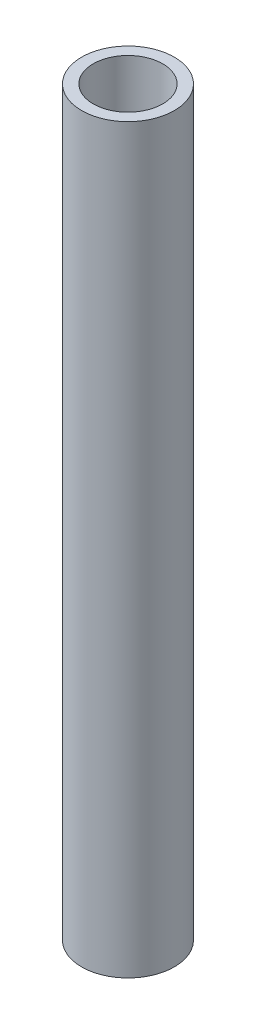
ISO-10303-21;
HEADER;
FILE_DESCRIPTION(('STEP AP214'),'2;1');
FILE_NAME('part.step','',(''),(''),'','','');
FILE_SCHEMA(('AUTOMOTIVE_DESIGN { 1 0 10303 214 1 1 1 1 }'));
ENDSEC;
DATA;
#1=APPLICATION_CONTEXT('core data for automotive mechanical design processes');
#2=APPLICATION_PROTOCOL_DEFINITION('international standard','automotive_design',2000,#1);
#3=PRODUCT_CONTEXT('',#1,'mechanical');
#4=PRODUCT('Part','Part','',(#3));
#5=PRODUCT_RELATED_PRODUCT_CATEGORY('part','',(#4));
#6=PRODUCT_DEFINITION_FORMATION('','',#4);
#7=PRODUCT_DEFINITION_CONTEXT('part definition',#1,'design');
#8=PRODUCT_DEFINITION('design','',#6,#7);
#9=PRODUCT_DEFINITION_SHAPE('','',#8);
#10=(LENGTH_UNIT() NAMED_UNIT(*) SI_UNIT(.MILLI.,.METRE.));
#11=(NAMED_UNIT(*) PLANE_ANGLE_UNIT() SI_UNIT($,.RADIAN.));
#12=(NAMED_UNIT(*) SI_UNIT($,.STERADIAN.) SOLID_ANGLE_UNIT());
#13=UNCERTAINTY_MEASURE_WITH_UNIT(LENGTH_MEASURE(1.E-05),#10,'distance_accuracy_value','');
#14=(GEOMETRIC_REPRESENTATION_CONTEXT(3) GLOBAL_UNCERTAINTY_ASSIGNED_CONTEXT((#13)) GLOBAL_UNIT_ASSIGNED_CONTEXT((#10,
#11,#12)) REPRESENTATION_CONTEXT('',''));
#15=CARTESIAN_POINT('',(0.,0.,0.));
#16=DIRECTION('',(0.,0.,1.));
#17=DIRECTION('',(1.,0.,0.));
#18=AXIS2_PLACEMENT_3D('',#15,#16,#17);
#19=CARTESIAN_POINT('',(0.,16.,0.));
#20=DIRECTION('',(0.,1.,0.));
#21=DIRECTION('',(0.,0.,1.));
#22=AXIS2_PLACEMENT_3D('',#19,#20,#21);
#23=PLANE('',#22);
#24=CARTESIAN_POINT('',(0.,16.,0.));
#25=DIRECTION('',(0.,1.,0.));
#26=DIRECTION('',(0.,0.,1.));
#27=AXIS2_PLACEMENT_3D('',#24,#25,#26);
#28=CIRCLE('',#27,1.);
#29=CARTESIAN_POINT('',(0.,16.,1.));
#30=VERTEX_POINT('',#29);
#31=EDGE_CURVE('E10',#30,#30,#28,.T.);
#32=ORIENTED_EDGE('',*,*,#31,.T.);
#33=EDGE_LOOP('',(#32));
#34=FACE_BOUND('',#33,.T.);
#35=CARTESIAN_POINT('',(0.,16.,0.));
#36=DIRECTION('',(0.,1.,0.));
#37=DIRECTION('',(0.,0.,1.));
#38=AXIS2_PLACEMENT_3D('',#35,#36,#37);
#39=CIRCLE('',#38,0.75);
#40=CARTESIAN_POINT('',(0.,16.,0.75));
#41=VERTEX_POINT('',#40);
#42=EDGE_CURVE('E42',#41,#41,#39,.T.);
#43=ORIENTED_EDGE('',*,*,#42,.F.);
#44=EDGE_LOOP('',(#43));
#45=FACE_BOUND('',#44,.T.);
#46=ADVANCED_FACE('F31',(#34,#45),#23,.T.);
#47=CARTESIAN_POINT('',(0.,0.,0.));
#48=DIRECTION('',(0.,1.,0.));
#49=DIRECTION('',(0.,0.,1.));
#50=AXIS2_PLACEMENT_3D('',#47,#48,#49);
#51=PLANE('',#50);
#52=CARTESIAN_POINT('',(0.,0.,0.));
#53=DIRECTION('',(0.,1.,0.));
#54=DIRECTION('',(0.,0.,1.));
#55=AXIS2_PLACEMENT_3D('',#52,#53,#54);
#56=CIRCLE('',#55,1.);
#57=CARTESIAN_POINT('',(0.,0.,1.));
#58=VERTEX_POINT('',#57);
#59=EDGE_CURVE('E35',#58,#58,#56,.T.);
#60=ORIENTED_EDGE('',*,*,#59,.F.);
#61=EDGE_LOOP('',(#60));
#62=FACE_BOUND('',#61,.T.);
#63=CARTESIAN_POINT('',(0.,0.,0.));
#64=DIRECTION('',(0.,1.,0.));
#65=DIRECTION('',(0.,0.,1.));
#66=AXIS2_PLACEMENT_3D('',#63,#64,#65);
#67=CIRCLE('',#66,0.75);
#68=CARTESIAN_POINT('',(0.,0.,0.75));
#69=VERTEX_POINT('',#68);
#70=EDGE_CURVE('E44',#69,#69,#67,.T.);
#71=ORIENTED_EDGE('',*,*,#70,.T.);
#72=EDGE_LOOP('',(#71));
#73=FACE_BOUND('',#72,.T.);
#74=ADVANCED_FACE('F54',(#62,#73),#51,.F.);
#75=CARTESIAN_POINT('',(0.,16.,0.));
#76=DIRECTION('',(0.,-1.,0.));
#77=DIRECTION('',(0.,0.,-1.));
#78=AXIS2_PLACEMENT_3D('',#75,#76,#77);
#79=CYLINDRICAL_SURFACE('',#78,1.);
#80=ORIENTED_EDGE('',*,*,#31,.F.);
#81=EDGE_LOOP('',(#80));
#82=FACE_BOUND('',#81,.T.);
#83=ORIENTED_EDGE('',*,*,#59,.T.);
#84=EDGE_LOOP('',(#83));
#85=FACE_BOUND('',#84,.T.);
#86=ADVANCED_FACE('F33',(#82,#85),#79,.T.);
#87=CARTESIAN_POINT('',(0.,16.,0.));
#88=DIRECTION('',(0.,-1.,0.));
#89=DIRECTION('',(0.,0.,-1.));
#90=AXIS2_PLACEMENT_3D('',#87,#88,#89);
#91=CYLINDRICAL_SURFACE('',#90,0.75);
#92=ORIENTED_EDGE('',*,*,#42,.T.);
#93=EDGE_LOOP('',(#92));
#94=FACE_BOUND('',#93,.T.);
#95=ORIENTED_EDGE('',*,*,#70,.F.);
#96=EDGE_LOOP('',(#95));
#97=FACE_BOUND('',#96,.T.);
#98=ADVANCED_FACE('F50',(#94,#97),#91,.F.);
#99=CLOSED_SHELL('',(#46,#74,#86,#98));
#100=MANIFOLD_SOLID_BREP('B2',#99);
#101=ADVANCED_BREP_SHAPE_REPRESENTATION('',(#18,#100),#14);
#102=SHAPE_DEFINITION_REPRESENTATION(#9,#101);
ENDSEC;
END-ISO-10303-21;
